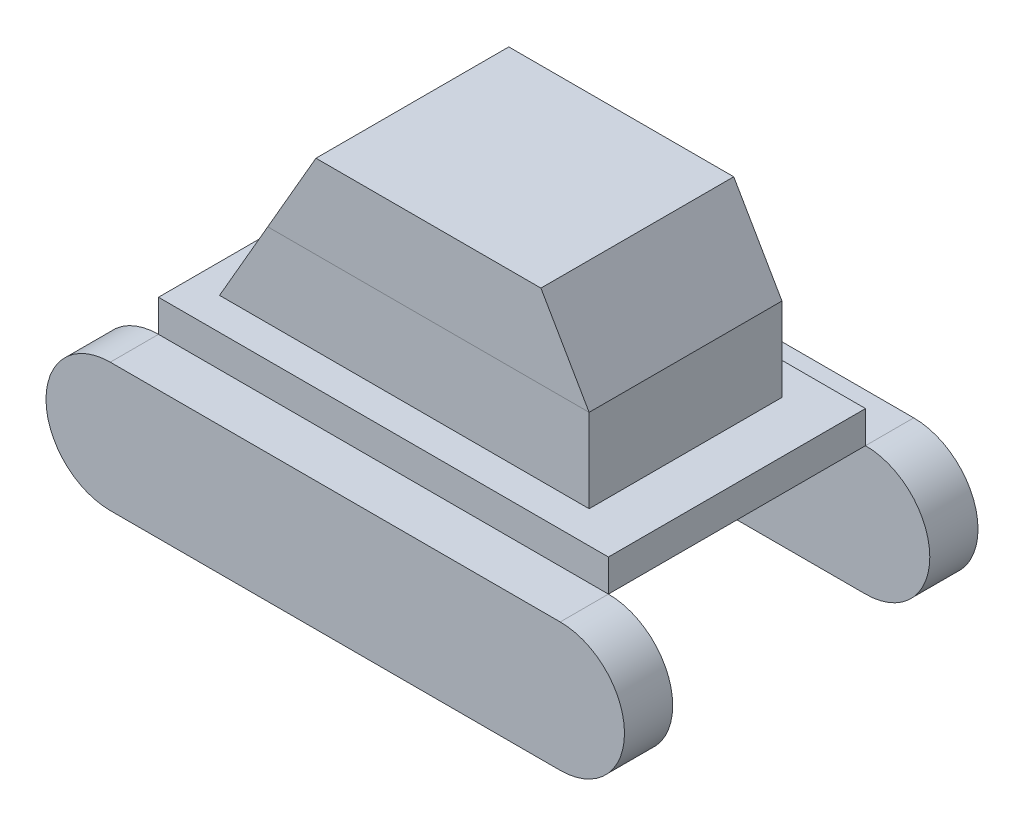
ISO-10303-21;
HEADER;
FILE_DESCRIPTION(('STEP AP214'),'2;1');
FILE_NAME('part.step','',(''),(''),'','','');
FILE_SCHEMA(('AUTOMOTIVE_DESIGN { 1 0 10303 214 1 1 1 1 }'));
ENDSEC;
DATA;
#1=APPLICATION_CONTEXT('core data for automotive mechanical design processes');
#2=APPLICATION_PROTOCOL_DEFINITION('international standard','automotive_design',2000,#1);
#3=PRODUCT_CONTEXT('',#1,'mechanical');
#4=PRODUCT('Part','Part','',(#3));
#5=PRODUCT_RELATED_PRODUCT_CATEGORY('part','',(#4));
#6=PRODUCT_DEFINITION_FORMATION('','',#4);
#7=PRODUCT_DEFINITION_CONTEXT('part definition',#1,'design');
#8=PRODUCT_DEFINITION('design','',#6,#7);
#9=PRODUCT_DEFINITION_SHAPE('','',#8);
#10=(LENGTH_UNIT() NAMED_UNIT(*) SI_UNIT(.MILLI.,.METRE.));
#11=(NAMED_UNIT(*) PLANE_ANGLE_UNIT() SI_UNIT($,.RADIAN.));
#12=(NAMED_UNIT(*) SI_UNIT($,.STERADIAN.) SOLID_ANGLE_UNIT());
#13=UNCERTAINTY_MEASURE_WITH_UNIT(LENGTH_MEASURE(1.E-05),#10,'distance_accuracy_value','');
#14=(GEOMETRIC_REPRESENTATION_CONTEXT(3) GLOBAL_UNCERTAINTY_ASSIGNED_CONTEXT((#13)) GLOBAL_UNIT_ASSIGNED_CONTEXT((#10,
#11,#12)) REPRESENTATION_CONTEXT('',''));
#15=CARTESIAN_POINT('',(0.,0.,0.));
#16=DIRECTION('',(0.,0.,1.));
#17=DIRECTION('',(1.,0.,0.));
#18=AXIS2_PLACEMENT_3D('',#15,#16,#17);
#19=CARTESIAN_POINT('',(0.,20.,110.));
#20=DIRECTION('',(0.,0.,-1.));
#21=DIRECTION('',(-1.,0.,0.));
#22=AXIS2_PLACEMENT_3D('',#19,#20,#21);
#23=CYLINDRICAL_SURFACE('',#22,20.);
#24=CARTESIAN_POINT('',(0.,20.,95.));
#25=DIRECTION('',(0.,0.,1.));
#26=DIRECTION('',(1.,0.,0.));
#27=AXIS2_PLACEMENT_3D('',#24,#25,#26);
#28=CIRCLE('',#27,20.);
#29=CARTESIAN_POINT('',(0.,40.,95.));
#30=VERTEX_POINT('',#29);
#31=CARTESIAN_POINT('',(0.,0.,95.));
#32=VERTEX_POINT('',#31);
#33=EDGE_CURVE('E110',#30,#32,#28,.T.);
#34=ORIENTED_EDGE('',*,*,#33,.T.);
#35=DIRECTION('',(0.,0.,-1.));
#36=VECTOR('',#35,1.);
#37=CARTESIAN_POINT('',(0.,0.,110.));
#38=LINE('',#37,#36);
#39=CARTESIAN_POINT('',(0.,0.,110.));
#40=VERTEX_POINT('',#39);
#41=EDGE_CURVE('E12',#40,#32,#38,.T.);
#42=ORIENTED_EDGE('',*,*,#41,.F.);
#43=CARTESIAN_POINT('',(0.,20.,110.));
#44=DIRECTION('',(0.,0.,1.));
#45=DIRECTION('',(1.,0.,0.));
#46=AXIS2_PLACEMENT_3D('',#43,#44,#45);
#47=CIRCLE('',#46,20.);
#48=CARTESIAN_POINT('',(0.,40.,110.));
#49=VERTEX_POINT('',#48);
#50=EDGE_CURVE('E98',#49,#40,#47,.T.);
#51=ORIENTED_EDGE('',*,*,#50,.F.);
#52=DIRECTION('',(0.,0.,-1.));
#53=VECTOR('',#52,1.);
#54=CARTESIAN_POINT('',(0.,40.,110.));
#55=LINE('',#54,#53);
#56=EDGE_CURVE('E106',#49,#30,#55,.T.);
#57=ORIENTED_EDGE('',*,*,#56,.T.);
#58=EDGE_LOOP('',(#34,#42,#51,#57));
#59=FACE_BOUND('',#58,.T.);
#60=ADVANCED_FACE('F47',(#59),#23,.T.);
#61=CARTESIAN_POINT('',(0.,0.,110.));
#62=DIRECTION('',(0.,1.,0.));
#63=DIRECTION('',(-1.,0.,0.));
#64=AXIS2_PLACEMENT_3D('',#61,#62,#63);
#65=PLANE('',#64);
#66=DIRECTION('',(1.,0.,0.));
#67=VECTOR('',#66,1.);
#68=CARTESIAN_POINT('',(0.,0.,95.));
#69=LINE('',#68,#67);
#70=CARTESIAN_POINT('',(140.,0.,95.));
#71=VERTEX_POINT('',#70);
#72=EDGE_CURVE('E102',#32,#71,#69,.T.);
#73=ORIENTED_EDGE('',*,*,#72,.T.);
#74=DIRECTION('',(0.,0.,-1.));
#75=VECTOR('',#74,1.);
#76=CARTESIAN_POINT('',(140.,0.,110.));
#77=LINE('',#76,#75);
#78=CARTESIAN_POINT('',(140.,0.,110.));
#79=VERTEX_POINT('',#78);
#80=EDGE_CURVE('E55',#79,#71,#77,.T.);
#81=ORIENTED_EDGE('',*,*,#80,.F.);
#82=DIRECTION('',(1.,0.,0.));
#83=VECTOR('',#82,1.);
#84=CARTESIAN_POINT('',(0.,0.,110.));
#85=LINE('',#84,#83);
#86=EDGE_CURVE('E93',#40,#79,#85,.T.);
#87=ORIENTED_EDGE('',*,*,#86,.F.);
#88=ORIENTED_EDGE('',*,*,#41,.T.);
#89=EDGE_LOOP('',(#73,#81,#87,#88));
#90=FACE_BOUND('',#89,.T.);
#91=ADVANCED_FACE('F101',(#90),#65,.F.);
#92=CARTESIAN_POINT('',(140.,20.,110.));
#93=DIRECTION('',(0.,0.,-1.));
#94=DIRECTION('',(-1.,0.,0.));
#95=AXIS2_PLACEMENT_3D('',#92,#93,#94);
#96=CYLINDRICAL_SURFACE('',#95,20.);
#97=CARTESIAN_POINT('',(140.,20.,95.));
#98=DIRECTION('',(0.,0.,1.));
#99=DIRECTION('',(1.,0.,0.));
#100=AXIS2_PLACEMENT_3D('',#97,#98,#99);
#101=CIRCLE('',#100,20.);
#102=CARTESIAN_POINT('',(140.,40.,95.));
#103=VERTEX_POINT('',#102);
#104=EDGE_CURVE('E80',#71,#103,#101,.T.);
#105=ORIENTED_EDGE('',*,*,#104,.T.);
#106=DIRECTION('',(0.,0.,-1.));
#107=VECTOR('',#106,1.);
#108=CARTESIAN_POINT('',(140.,40.,110.));
#109=LINE('',#108,#107);
#110=CARTESIAN_POINT('',(140.,40.,110.));
#111=VERTEX_POINT('',#110);
#112=EDGE_CURVE('E103',#111,#103,#109,.T.);
#113=ORIENTED_EDGE('',*,*,#112,.F.);
#114=CARTESIAN_POINT('',(140.,20.,110.));
#115=DIRECTION('',(0.,0.,1.));
#116=DIRECTION('',(1.,0.,0.));
#117=AXIS2_PLACEMENT_3D('',#114,#115,#116);
#118=CIRCLE('',#117,20.);
#119=EDGE_CURVE('E96',#79,#111,#118,.T.);
#120=ORIENTED_EDGE('',*,*,#119,.F.);
#121=ORIENTED_EDGE('',*,*,#80,.T.);
#122=EDGE_LOOP('',(#105,#113,#120,#121));
#123=FACE_BOUND('',#122,.T.);
#124=ADVANCED_FACE('F104',(#123),#96,.T.);
#125=CARTESIAN_POINT('',(0.,40.,110.));
#126=DIRECTION('',(0.,-1.,0.));
#127=DIRECTION('',(1.,0.,0.));
#128=AXIS2_PLACEMENT_3D('',#125,#126,#127);
#129=PLANE('',#128);
#130=DIRECTION('',(-1.,0.,0.));
#131=VECTOR('',#130,1.);
#132=CARTESIAN_POINT('',(0.,40.,95.));
#133=LINE('',#132,#131);
#134=EDGE_CURVE('E86',#103,#30,#133,.T.);
#135=ORIENTED_EDGE('',*,*,#134,.T.);
#136=ORIENTED_EDGE('',*,*,#56,.F.);
#137=DIRECTION('',(-1.,0.,0.));
#138=VECTOR('',#137,1.);
#139=CARTESIAN_POINT('',(0.,40.,110.));
#140=LINE('',#139,#138);
#141=EDGE_CURVE('E63',#111,#49,#140,.T.);
#142=ORIENTED_EDGE('',*,*,#141,.F.);
#143=ORIENTED_EDGE('',*,*,#112,.T.);
#144=EDGE_LOOP('',(#135,#136,#142,#143));
#145=FACE_BOUND('',#144,.T.);
#146=ADVANCED_FACE('F117',(#145),#129,.F.);
#147=CARTESIAN_POINT('',(0.,20.,110.));
#148=DIRECTION('',(0.,0.,1.));
#149=DIRECTION('',(1.,0.,0.));
#150=AXIS2_PLACEMENT_3D('',#147,#148,#149);
#151=PLANE('',#150);
#152=ORIENTED_EDGE('',*,*,#50,.T.);
#153=ORIENTED_EDGE('',*,*,#86,.T.);
#154=ORIENTED_EDGE('',*,*,#119,.T.);
#155=ORIENTED_EDGE('',*,*,#141,.T.);
#156=EDGE_LOOP('',(#152,#153,#154,#155));
#157=FACE_BOUND('',#156,.T.);
#158=ADVANCED_FACE('F94',(#157),#151,.T.);
#159=CARTESIAN_POINT('',(0.,20.,95.));
#160=DIRECTION('',(0.,0.,1.));
#161=DIRECTION('',(1.,0.,0.));
#162=AXIS2_PLACEMENT_3D('',#159,#160,#161);
#163=PLANE('',#162);
#164=ORIENTED_EDGE('',*,*,#33,.F.);
#165=ORIENTED_EDGE('',*,*,#134,.F.);
#166=ORIENTED_EDGE('',*,*,#104,.F.);
#167=ORIENTED_EDGE('',*,*,#72,.F.);
#168=EDGE_LOOP('',(#164,#165,#166,#167));
#169=FACE_BOUND('',#168,.T.);
#170=ADVANCED_FACE('F120',(#169),#163,.F.);
#171=CLOSED_SHELL('',(#60,#91,#124,#146,#158,#170));
#172=MANIFOLD_SOLID_BREP('B2',#171);
#173=CARTESIAN_POINT('',(9.,50.,85.));
#174=DIRECTION('',(-0.866025403784436,0.500000000000004,0.));
#175=DIRECTION('',(-0.500000000000004,-0.866025403784436,0.));
#176=AXIS2_PLACEMENT_3D('',#173,#174,#175);
#177=PLANE('',#176);
#178=DIRECTION('',(0.,0.,-1.));
#179=VECTOR('',#178,1.);
#180=CARTESIAN_POINT('',(24.0000000000001,75.9807621135331,85.));
#181=LINE('',#180,#179);
#182=CARTESIAN_POINT('',(24.0000000000001,75.9807621135331,55.));
#183=VERTEX_POINT('',#182);
#184=CARTESIAN_POINT('',(24.0000000000001,75.9807621135331,25.));
#185=VERTEX_POINT('',#184);
#186=EDGE_CURVE('E365',#183,#185,#181,.T.);
#187=ORIENTED_EDGE('',*,*,#186,.F.);
#188=DIRECTION('',(0.500000000000004,0.866025403784436,0.));
#189=VECTOR('',#188,1.);
#190=CARTESIAN_POINT('',(9.,50.,55.));
#191=LINE('',#190,#189);
#192=CARTESIAN_POINT('',(39.0000000000002,101.961524227066,55.));
#193=VERTEX_POINT('',#192);
#194=EDGE_CURVE('E45',#183,#193,#191,.T.);
#195=ORIENTED_EDGE('',*,*,#194,.T.);
#196=DIRECTION('',(0.,0.,-1.));
#197=VECTOR('',#196,1.);
#198=CARTESIAN_POINT('',(39.0000000000002,101.961524227066,85.));
#199=LINE('',#198,#197);
#200=CARTESIAN_POINT('',(39.0000000000002,101.961524227066,25.));
#201=VERTEX_POINT('',#200);
#202=EDGE_CURVE('E283',#193,#201,#199,.T.);
#203=ORIENTED_EDGE('',*,*,#202,.T.);
#204=DIRECTION('',(0.500000000000004,0.866025403784436,0.));
#205=VECTOR('',#204,1.);
#206=CARTESIAN_POINT('',(9.,50.,25.));
#207=LINE('',#206,#205);
#208=EDGE_CURVE('E315',#185,#201,#207,.T.);
#209=ORIENTED_EDGE('',*,*,#208,.F.);
#210=EDGE_LOOP('',(#187,#195,#203,#209));
#211=FACE_BOUND('',#210,.T.);
#212=ADVANCED_FACE('F192',(#211),#177,.T.);
#213=DIRECTION('',(0.500000000000004,0.866025403784436,0.));
#214=VECTOR('',#213,1.);
#215=CARTESIAN_POINT('',(9.,50.,85.));
#216=LINE('',#215,#214);
#217=CARTESIAN_POINT('',(9.,50.,85.));
#218=VERTEX_POINT('',#217);
#219=CARTESIAN_POINT('',(24.0000000000001,75.9807621135331,85.));
#220=VERTEX_POINT('',#219);
#221=EDGE_CURVE('E276',#218,#220,#216,.T.);
#222=ORIENTED_EDGE('',*,*,#221,.T.);
#223=EDGE_CURVE('E201',#220,#183,#181,.T.);
#224=ORIENTED_EDGE('',*,*,#223,.T.);
#225=ORIENTED_EDGE('',*,*,#186,.T.);
#226=CARTESIAN_POINT('',(9.,50.,25.));
#227=VERTEX_POINT('',#226);
#228=EDGE_CURVE('E278',#227,#185,#207,.T.);
#229=ORIENTED_EDGE('',*,*,#228,.F.);
#230=DIRECTION('',(0.,0.,-1.));
#231=VECTOR('',#230,1.);
#232=CARTESIAN_POINT('',(9.,50.,85.));
#233=LINE('',#232,#231);
#234=EDGE_CURVE('E272',#218,#227,#233,.T.);
#235=ORIENTED_EDGE('',*,*,#234,.F.);
#236=EDGE_LOOP('',(#222,#224,#225,#229,#235));
#237=FACE_BOUND('',#236,.T.);
#238=ADVANCED_FACE('F274',(#237),#177,.T.);
#239=CARTESIAN_POINT('',(0.,0.,25.));
#240=DIRECTION('',(0.,0.,1.));
#241=DIRECTION('',(1.,0.,0.));
#242=AXIS2_PLACEMENT_3D('',#239,#240,#241);
#243=PLANE('',#242);
#244=DIRECTION('',(-1.,0.,0.));
#245=VECTOR('',#244,1.);
#246=CARTESIAN_POINT('',(0.,75.9807621135331,25.));
#247=LINE('',#246,#245);
#248=CARTESIAN_POINT('',(124.,75.980762113533,25.));
#249=VERTEX_POINT('',#248);
#250=EDGE_CURVE('E362',#249,#185,#247,.T.);
#251=ORIENTED_EDGE('',*,*,#250,.F.);
#252=DIRECTION('',(0.,-1.,0.));
#253=VECTOR('',#252,1.);
#254=CARTESIAN_POINT('',(124.,75.980762113533,25.));
#255=LINE('',#254,#253);
#256=CARTESIAN_POINT('',(124.,50.,25.));
#257=VERTEX_POINT('',#256);
#258=EDGE_CURVE('E302',#249,#257,#255,.T.);
#259=ORIENTED_EDGE('',*,*,#258,.T.);
#260=DIRECTION('',(-1.,0.,0.));
#261=VECTOR('',#260,1.);
#262=CARTESIAN_POINT('',(124.,50.,25.));
#263=LINE('',#262,#261);
#264=EDGE_CURVE('E313',#257,#227,#263,.T.);
#265=ORIENTED_EDGE('',*,*,#264,.T.);
#266=ORIENTED_EDGE('',*,*,#228,.T.);
#267=EDGE_LOOP('',(#251,#259,#265,#266));
#268=FACE_BOUND('',#267,.T.);
#269=ADVANCED_FACE('F380',(#268),#243,.F.);
#270=CARTESIAN_POINT('',(0.,0.,85.));
#271=DIRECTION('',(0.,0.,1.));
#272=DIRECTION('',(1.,0.,0.));
#273=AXIS2_PLACEMENT_3D('',#270,#271,#272);
#274=PLANE('',#273);
#275=CARTESIAN_POINT('',(39.0000000000002,101.961524227066,85.));
#276=VERTEX_POINT('',#275);
#277=EDGE_CURVE('E295',#220,#276,#216,.T.);
#278=ORIENTED_EDGE('',*,*,#277,.F.);
#279=DIRECTION('',(1.,0.,0.));
#280=VECTOR('',#279,1.);
#281=CARTESIAN_POINT('',(0.,75.9807621135331,85.));
#282=LINE('',#281,#280);
#283=CARTESIAN_POINT('',(124.,75.980762113533,85.));
#284=VERTEX_POINT('',#283);
#285=EDGE_CURVE('E292',#220,#284,#282,.T.);
#286=ORIENTED_EDGE('',*,*,#285,.T.);
#287=DIRECTION('',(0.499999999999998,-0.86602540378444,0.));
#288=VECTOR('',#287,1.);
#289=CARTESIAN_POINT('',(109.,101.961524227066,85.));
#290=LINE('',#289,#288);
#291=CARTESIAN_POINT('',(109.,101.961524227066,85.));
#292=VERTEX_POINT('',#291);
#293=EDGE_CURVE('E309',#292,#284,#290,.T.);
#294=ORIENTED_EDGE('',*,*,#293,.F.);
#295=DIRECTION('',(1.,0.,0.));
#296=VECTOR('',#295,1.);
#297=CARTESIAN_POINT('',(39.0000000000002,101.961524227066,85.));
#298=LINE('',#297,#296);
#299=EDGE_CURVE('E294',#276,#292,#298,.T.);
#300=ORIENTED_EDGE('',*,*,#299,.F.);
#301=EDGE_LOOP('',(#278,#286,#294,#300));
#302=FACE_BOUND('',#301,.T.);
#303=ADVANCED_FACE('F389',(#302),#274,.T.);
#304=CARTESIAN_POINT('',(0.,50.,15.));
#305=DIRECTION('',(1.,0.,0.));
#306=DIRECTION('',(0.,0.,-1.));
#307=AXIS2_PLACEMENT_3D('',#304,#305,#306);
#308=PLANE('',#307);
#309=DIRECTION('',(0.,0.,1.));
#310=VECTOR('',#309,1.);
#311=CARTESIAN_POINT('',(0.,40.,15.));
#312=LINE('',#311,#310);
#313=CARTESIAN_POINT('',(0.,40.,15.));
#314=VERTEX_POINT('',#313);
#315=CARTESIAN_POINT('',(0.,40.,95.));
#316=VERTEX_POINT('',#315);
#317=EDGE_CURVE('E323',#314,#316,#312,.T.);
#318=ORIENTED_EDGE('',*,*,#317,.T.);
#319=DIRECTION('',(0.,-1.,0.));
#320=VECTOR('',#319,1.);
#321=CARTESIAN_POINT('',(0.,50.,95.));
#322=LINE('',#321,#320);
#323=CARTESIAN_POINT('',(0.,50.,95.));
#324=VERTEX_POINT('',#323);
#325=EDGE_CURVE('E357',#324,#316,#322,.T.);
#326=ORIENTED_EDGE('',*,*,#325,.F.);
#327=DIRECTION('',(0.,0.,1.));
#328=VECTOR('',#327,1.);
#329=CARTESIAN_POINT('',(0.,50.,15.));
#330=LINE('',#329,#328);
#331=CARTESIAN_POINT('',(0.,50.,15.));
#332=VERTEX_POINT('',#331);
#333=EDGE_CURVE('E331',#332,#324,#330,.T.);
#334=ORIENTED_EDGE('',*,*,#333,.F.);
#335=DIRECTION('',(0.,-1.,0.));
#336=VECTOR('',#335,1.);
#337=CARTESIAN_POINT('',(0.,50.,15.));
#338=LINE('',#337,#336);
#339=EDGE_CURVE('E341',#332,#314,#338,.T.);
#340=ORIENTED_EDGE('',*,*,#339,.T.);
#341=EDGE_LOOP('',(#318,#326,#334,#340));
#342=FACE_BOUND('',#341,.T.);
#343=ADVANCED_FACE('F194',(#342),#308,.F.);
#344=CARTESIAN_POINT('',(0.,50.,95.));
#345=DIRECTION('',(0.,0.,-1.));
#346=DIRECTION('',(-1.,0.,0.));
#347=AXIS2_PLACEMENT_3D('',#344,#345,#346);
#348=PLANE('',#347);
#349=DIRECTION('',(1.,0.,0.));
#350=VECTOR('',#349,1.);
#351=CARTESIAN_POINT('',(0.,40.,95.));
#352=LINE('',#351,#350);
#353=CARTESIAN_POINT('',(140.,40.,95.));
#354=VERTEX_POINT('',#353);
#355=EDGE_CURVE('E344',#316,#354,#352,.T.);
#356=ORIENTED_EDGE('',*,*,#355,.T.);
#357=DIRECTION('',(0.,-1.,0.));
#358=VECTOR('',#357,1.);
#359=CARTESIAN_POINT('',(140.,50.,95.));
#360=LINE('',#359,#358);
#361=CARTESIAN_POINT('',(140.,50.,95.));
#362=VERTEX_POINT('',#361);
#363=EDGE_CURVE('E354',#362,#354,#360,.T.);
#364=ORIENTED_EDGE('',*,*,#363,.F.);
#365=DIRECTION('',(1.,0.,0.));
#366=VECTOR('',#365,1.);
#367=CARTESIAN_POINT('',(0.,50.,95.));
#368=LINE('',#367,#366);
#369=EDGE_CURVE('E334',#324,#362,#368,.T.);
#370=ORIENTED_EDGE('',*,*,#369,.F.);
#371=ORIENTED_EDGE('',*,*,#325,.T.);
#372=EDGE_LOOP('',(#356,#364,#370,#371));
#373=FACE_BOUND('',#372,.T.);
#374=ADVANCED_FACE('F450',(#373),#348,.F.);
#375=CARTESIAN_POINT('',(140.,50.,15.));
#376=DIRECTION('',(-1.,0.,0.));
#377=DIRECTION('',(0.,0.,1.));
#378=AXIS2_PLACEMENT_3D('',#375,#376,#377);
#379=PLANE('',#378);
#380=DIRECTION('',(0.,0.,-1.));
#381=VECTOR('',#380,1.);
#382=CARTESIAN_POINT('',(140.,40.,15.));
#383=LINE('',#382,#381);
#384=CARTESIAN_POINT('',(140.,40.,15.));
#385=VERTEX_POINT('',#384);
#386=EDGE_CURVE('E346',#354,#385,#383,.T.);
#387=ORIENTED_EDGE('',*,*,#386,.T.);
#388=DIRECTION('',(0.,-1.,0.));
#389=VECTOR('',#388,1.);
#390=CARTESIAN_POINT('',(140.,50.,15.));
#391=LINE('',#390,#389);
#392=CARTESIAN_POINT('',(140.,50.,15.));
#393=VERTEX_POINT('',#392);
#394=EDGE_CURVE('E351',#393,#385,#391,.T.);
#395=ORIENTED_EDGE('',*,*,#394,.F.);
#396=DIRECTION('',(0.,0.,-1.));
#397=VECTOR('',#396,1.);
#398=CARTESIAN_POINT('',(140.,50.,15.));
#399=LINE('',#398,#397);
#400=EDGE_CURVE('E337',#362,#393,#399,.T.);
#401=ORIENTED_EDGE('',*,*,#400,.F.);
#402=ORIENTED_EDGE('',*,*,#363,.T.);
#403=EDGE_LOOP('',(#387,#395,#401,#402));
#404=FACE_BOUND('',#403,.T.);
#405=ADVANCED_FACE('F495',(#404),#379,.F.);
#406=CARTESIAN_POINT('',(0.,50.,15.));
#407=DIRECTION('',(0.,0.,1.));
#408=DIRECTION('',(1.,0.,0.));
#409=AXIS2_PLACEMENT_3D('',#406,#407,#408);
#410=PLANE('',#409);
#411=DIRECTION('',(-1.,0.,0.));
#412=VECTOR('',#411,1.);
#413=CARTESIAN_POINT('',(0.,40.,15.));
#414=LINE('',#413,#412);
#415=EDGE_CURVE('E335',#385,#314,#414,.T.);
#416=ORIENTED_EDGE('',*,*,#415,.T.);
#417=ORIENTED_EDGE('',*,*,#339,.F.);
#418=DIRECTION('',(-1.,0.,0.));
#419=VECTOR('',#418,1.);
#420=CARTESIAN_POINT('',(0.,50.,15.));
#421=LINE('',#420,#419);
#422=EDGE_CURVE('E339',#393,#332,#421,.T.);
#423=ORIENTED_EDGE('',*,*,#422,.F.);
#424=ORIENTED_EDGE('',*,*,#394,.T.);
#425=EDGE_LOOP('',(#416,#417,#423,#424));
#426=FACE_BOUND('',#425,.T.);
#427=ADVANCED_FACE('F490',(#426),#410,.F.);
#428=CARTESIAN_POINT('',(0.,50.,0.));
#429=DIRECTION('',(0.,1.,0.));
#430=DIRECTION('',(0.,0.,1.));
#431=AXIS2_PLACEMENT_3D('',#428,#429,#430);
#432=PLANE('',#431);
#433=DIRECTION('',(-1.,0.,0.));
#434=VECTOR('',#433,1.);
#435=CARTESIAN_POINT('',(124.,50.,85.));
#436=LINE('',#435,#434);
#437=CARTESIAN_POINT('',(124.,50.,85.));
#438=VERTEX_POINT('',#437);
#439=EDGE_CURVE('E290',#438,#218,#436,.T.);
#440=ORIENTED_EDGE('',*,*,#439,.T.);
#441=ORIENTED_EDGE('',*,*,#234,.T.);
#442=ORIENTED_EDGE('',*,*,#264,.F.);
#443=DIRECTION('',(0.,0.,-1.));
#444=VECTOR('',#443,1.);
#445=CARTESIAN_POINT('',(124.,50.,85.));
#446=LINE('',#445,#444);
#447=EDGE_CURVE('E301',#438,#257,#446,.T.);
#448=ORIENTED_EDGE('',*,*,#447,.F.);
#449=EDGE_LOOP('',(#440,#441,#442,#448));
#450=FACE_BOUND('',#449,.T.);
#451=ORIENTED_EDGE('',*,*,#333,.T.);
#452=ORIENTED_EDGE('',*,*,#369,.T.);
#453=ORIENTED_EDGE('',*,*,#400,.T.);
#454=ORIENTED_EDGE('',*,*,#422,.T.);
#455=EDGE_LOOP('',(#451,#452,#453,#454));
#456=FACE_BOUND('',#455,.T.);
#457=ADVANCED_FACE('F298',(#450,#456),#432,.T.);
#458=CARTESIAN_POINT('',(0.,40.,0.));
#459=DIRECTION('',(0.,1.,0.));
#460=DIRECTION('',(0.,0.,1.));
#461=AXIS2_PLACEMENT_3D('',#458,#459,#460);
#462=PLANE('',#461);
#463=ORIENTED_EDGE('',*,*,#317,.F.);
#464=ORIENTED_EDGE('',*,*,#415,.F.);
#465=ORIENTED_EDGE('',*,*,#386,.F.);
#466=ORIENTED_EDGE('',*,*,#355,.F.);
#467=EDGE_LOOP('',(#463,#464,#465,#466));
#468=FACE_BOUND('',#467,.T.);
#469=ADVANCED_FACE('F508',(#468),#462,.F.);
#470=CARTESIAN_POINT('',(124.,75.980762113533,85.));
#471=DIRECTION('',(1.,0.,0.));
#472=DIRECTION('',(0.,0.,-1.));
#473=AXIS2_PLACEMENT_3D('',#470,#471,#472);
#474=PLANE('',#473);
#475=ORIENTED_EDGE('',*,*,#258,.F.);
#476=DIRECTION('',(0.,0.,-1.));
#477=VECTOR('',#476,1.);
#478=CARTESIAN_POINT('',(124.,75.980762113533,85.));
#479=LINE('',#478,#477);
#480=EDGE_CURVE('E324',#284,#249,#479,.T.);
#481=ORIENTED_EDGE('',*,*,#480,.F.);
#482=DIRECTION('',(0.,-1.,0.));
#483=VECTOR('',#482,1.);
#484=CARTESIAN_POINT('',(124.,75.980762113533,85.));
#485=LINE('',#484,#483);
#486=EDGE_CURVE('E284',#284,#438,#485,.T.);
#487=ORIENTED_EDGE('',*,*,#486,.T.);
#488=ORIENTED_EDGE('',*,*,#447,.T.);
#489=EDGE_LOOP('',(#475,#481,#487,#488));
#490=FACE_BOUND('',#489,.T.);
#491=ADVANCED_FACE('F383',(#490),#474,.T.);
#492=CARTESIAN_POINT('',(109.,101.961524227066,85.));
#493=DIRECTION('',(0.86602540378444,0.499999999999998,0.));
#494=DIRECTION('',(-0.499999999999998,0.86602540378444,0.));
#495=AXIS2_PLACEMENT_3D('',#492,#493,#494);
#496=PLANE('',#495);
#497=DIRECTION('',(0.499999999999998,-0.86602540378444,0.));
#498=VECTOR('',#497,1.);
#499=CARTESIAN_POINT('',(109.,101.961524227066,25.));
#500=LINE('',#499,#498);
#501=CARTESIAN_POINT('',(109.,101.961524227066,25.));
#502=VERTEX_POINT('',#501);
#503=EDGE_CURVE('E304',#502,#249,#500,.T.);
#504=ORIENTED_EDGE('',*,*,#503,.F.);
#505=DIRECTION('',(0.,0.,-1.));
#506=VECTOR('',#505,1.);
#507=CARTESIAN_POINT('',(109.,101.961524227066,85.));
#508=LINE('',#507,#506);
#509=EDGE_CURVE('E327',#292,#502,#508,.T.);
#510=ORIENTED_EDGE('',*,*,#509,.F.);
#511=ORIENTED_EDGE('',*,*,#293,.T.);
#512=ORIENTED_EDGE('',*,*,#480,.T.);
#513=EDGE_LOOP('',(#504,#510,#511,#512));
#514=FACE_BOUND('',#513,.T.);
#515=ADVANCED_FACE('F386',(#514),#496,.T.);
#516=CARTESIAN_POINT('',(39.0000000000002,101.961524227066,85.));
#517=DIRECTION('',(0.,1.,0.));
#518=DIRECTION('',(0.,0.,1.));
#519=AXIS2_PLACEMENT_3D('',#516,#517,#518);
#520=PLANE('',#519);
#521=DIRECTION('',(1.,0.,0.));
#522=VECTOR('',#521,1.);
#523=CARTESIAN_POINT('',(39.0000000000002,101.961524227066,25.));
#524=LINE('',#523,#522);
#525=EDGE_CURVE('E317',#201,#502,#524,.T.);
#526=ORIENTED_EDGE('',*,*,#525,.F.);
#527=ORIENTED_EDGE('',*,*,#202,.F.);
#528=EDGE_CURVE('E329',#276,#193,#199,.T.);
#529=ORIENTED_EDGE('',*,*,#528,.F.);
#530=ORIENTED_EDGE('',*,*,#299,.T.);
#531=ORIENTED_EDGE('',*,*,#509,.T.);
#532=EDGE_LOOP('',(#526,#527,#529,#530,#531));
#533=FACE_BOUND('',#532,.T.);
#534=ADVANCED_FACE('F392',(#533),#520,.T.);
#535=ORIENTED_EDGE('',*,*,#194,.F.);
#536=ORIENTED_EDGE('',*,*,#223,.F.);
#537=ORIENTED_EDGE('',*,*,#277,.T.);
#538=ORIENTED_EDGE('',*,*,#528,.T.);
#539=EDGE_LOOP('',(#535,#536,#537,#538));
#540=FACE_BOUND('',#539,.T.);
#541=ADVANCED_FACE('F393',(#540),#177,.T.);
#542=ORIENTED_EDGE('',*,*,#285,.F.);
#543=ORIENTED_EDGE('',*,*,#221,.F.);
#544=ORIENTED_EDGE('',*,*,#439,.F.);
#545=ORIENTED_EDGE('',*,*,#486,.F.);
#546=EDGE_LOOP('',(#542,#543,#544,#545));
#547=FACE_BOUND('',#546,.T.);
#548=ADVANCED_FACE('F288',(#547),#274,.T.);
#549=ORIENTED_EDGE('',*,*,#503,.T.);
#550=ORIENTED_EDGE('',*,*,#250,.T.);
#551=ORIENTED_EDGE('',*,*,#208,.T.);
#552=ORIENTED_EDGE('',*,*,#525,.T.);
#553=EDGE_LOOP('',(#549,#550,#551,#552));
#554=FACE_BOUND('',#553,.T.);
#555=ADVANCED_FACE('F375',(#554),#243,.F.);
#556=CLOSED_SHELL('',(#212,#238,#269,#303,#343,#374,#405,#427,#457,#469,#491,#515,#534,#541,
#548,#555));
#557=MANIFOLD_SOLID_BREP('B6',#556);
#558=CARTESIAN_POINT('',(0.,20.,15.));
#559=DIRECTION('',(0.,0.,-1.));
#560=DIRECTION('',(-1.,0.,0.));
#561=AXIS2_PLACEMENT_3D('',#558,#559,#560);
#562=CYLINDRICAL_SURFACE('',#561,20.);
#563=CARTESIAN_POINT('',(0.,20.,0.));
#564=DIRECTION('',(0.,0.,1.));
#565=DIRECTION('',(1.,0.,0.));
#566=AXIS2_PLACEMENT_3D('',#563,#564,#565);
#567=CIRCLE('',#566,20.);
#568=CARTESIAN_POINT('',(0.,40.,0.));
#569=VERTEX_POINT('',#568);
#570=CARTESIAN_POINT('',(0.,0.,0.));
#571=VERTEX_POINT('',#570);
#572=EDGE_CURVE('E657',#569,#571,#567,.T.);
#573=ORIENTED_EDGE('',*,*,#572,.T.);
#574=DIRECTION('',(0.,0.,-1.));
#575=VECTOR('',#574,1.);
#576=CARTESIAN_POINT('',(0.,0.,15.));
#577=LINE('',#576,#575);
#578=CARTESIAN_POINT('',(0.,0.,15.));
#579=VERTEX_POINT('',#578);
#580=EDGE_CURVE('E190',#579,#571,#577,.T.);
#581=ORIENTED_EDGE('',*,*,#580,.F.);
#582=CARTESIAN_POINT('',(0.,20.,15.));
#583=DIRECTION('',(0.,0.,1.));
#584=DIRECTION('',(1.,0.,0.));
#585=AXIS2_PLACEMENT_3D('',#582,#583,#584);
#586=CIRCLE('',#585,20.);
#587=CARTESIAN_POINT('',(0.,40.,15.));
#588=VERTEX_POINT('',#587);
#589=EDGE_CURVE('E645',#588,#579,#586,.T.);
#590=ORIENTED_EDGE('',*,*,#589,.F.);
#591=DIRECTION('',(0.,0.,-1.));
#592=VECTOR('',#591,1.);
#593=CARTESIAN_POINT('',(0.,40.,15.));
#594=LINE('',#593,#592);
#595=EDGE_CURVE('E653',#588,#569,#594,.T.);
#596=ORIENTED_EDGE('',*,*,#595,.T.);
#597=EDGE_LOOP('',(#573,#581,#590,#596));
#598=FACE_BOUND('',#597,.T.);
#599=ADVANCED_FACE('F594',(#598),#562,.T.);
#600=CARTESIAN_POINT('',(0.,0.,15.));
#601=DIRECTION('',(0.,1.,0.));
#602=DIRECTION('',(0.,0.,1.));
#603=AXIS2_PLACEMENT_3D('',#600,#601,#602);
#604=PLANE('',#603);
#605=DIRECTION('',(1.,0.,0.));
#606=VECTOR('',#605,1.);
#607=CARTESIAN_POINT('',(0.,0.,0.));
#608=LINE('',#607,#606);
#609=CARTESIAN_POINT('',(140.,0.,0.));
#610=VERTEX_POINT('',#609);
#611=EDGE_CURVE('E649',#571,#610,#608,.T.);
#612=ORIENTED_EDGE('',*,*,#611,.T.);
#613=DIRECTION('',(0.,0.,-1.));
#614=VECTOR('',#613,1.);
#615=CARTESIAN_POINT('',(140.,0.,15.));
#616=LINE('',#615,#614);
#617=CARTESIAN_POINT('',(140.,0.,15.));
#618=VERTEX_POINT('',#617);
#619=EDGE_CURVE('E602',#618,#610,#616,.T.);
#620=ORIENTED_EDGE('',*,*,#619,.F.);
#621=DIRECTION('',(1.,0.,0.));
#622=VECTOR('',#621,1.);
#623=CARTESIAN_POINT('',(0.,0.,15.));
#624=LINE('',#623,#622);
#625=EDGE_CURVE('E640',#579,#618,#624,.T.);
#626=ORIENTED_EDGE('',*,*,#625,.F.);
#627=ORIENTED_EDGE('',*,*,#580,.T.);
#628=EDGE_LOOP('',(#612,#620,#626,#627));
#629=FACE_BOUND('',#628,.T.);
#630=ADVANCED_FACE('F648',(#629),#604,.F.);
#631=CARTESIAN_POINT('',(140.,20.,15.));
#632=DIRECTION('',(0.,0.,-1.));
#633=DIRECTION('',(-1.,0.,0.));
#634=AXIS2_PLACEMENT_3D('',#631,#632,#633);
#635=CYLINDRICAL_SURFACE('',#634,20.);
#636=CARTESIAN_POINT('',(140.,20.,0.));
#637=DIRECTION('',(0.,0.,1.));
#638=DIRECTION('',(1.,0.,0.));
#639=AXIS2_PLACEMENT_3D('',#636,#637,#638);
#640=CIRCLE('',#639,20.);
#641=CARTESIAN_POINT('',(140.,40.,0.));
#642=VERTEX_POINT('',#641);
#643=EDGE_CURVE('E627',#610,#642,#640,.T.);
#644=ORIENTED_EDGE('',*,*,#643,.T.);
#645=DIRECTION('',(0.,0.,-1.));
#646=VECTOR('',#645,1.);
#647=CARTESIAN_POINT('',(140.,40.,15.));
#648=LINE('',#647,#646);
#649=CARTESIAN_POINT('',(140.,40.,15.));
#650=VERTEX_POINT('',#649);
#651=EDGE_CURVE('E650',#650,#642,#648,.T.);
#652=ORIENTED_EDGE('',*,*,#651,.F.);
#653=CARTESIAN_POINT('',(140.,20.,15.));
#654=DIRECTION('',(0.,0.,1.));
#655=DIRECTION('',(1.,0.,0.));
#656=AXIS2_PLACEMENT_3D('',#653,#654,#655);
#657=CIRCLE('',#656,20.);
#658=EDGE_CURVE('E643',#618,#650,#657,.T.);
#659=ORIENTED_EDGE('',*,*,#658,.F.);
#660=ORIENTED_EDGE('',*,*,#619,.T.);
#661=EDGE_LOOP('',(#644,#652,#659,#660));
#662=FACE_BOUND('',#661,.T.);
#663=ADVANCED_FACE('F651',(#662),#635,.T.);
#664=CARTESIAN_POINT('',(0.,40.,15.));
#665=DIRECTION('',(0.,-1.,0.));
#666=DIRECTION('',(1.,0.,0.));
#667=AXIS2_PLACEMENT_3D('',#664,#665,#666);
#668=PLANE('',#667);
#669=DIRECTION('',(-1.,0.,0.));
#670=VECTOR('',#669,1.);
#671=CARTESIAN_POINT('',(0.,40.,0.));
#672=LINE('',#671,#670);
#673=EDGE_CURVE('E633',#642,#569,#672,.T.);
#674=ORIENTED_EDGE('',*,*,#673,.T.);
#675=ORIENTED_EDGE('',*,*,#595,.F.);
#676=DIRECTION('',(-1.,0.,0.));
#677=VECTOR('',#676,1.);
#678=CARTESIAN_POINT('',(0.,40.,15.));
#679=LINE('',#678,#677);
#680=EDGE_CURVE('E610',#650,#588,#679,.T.);
#681=ORIENTED_EDGE('',*,*,#680,.F.);
#682=ORIENTED_EDGE('',*,*,#651,.T.);
#683=EDGE_LOOP('',(#674,#675,#681,#682));
#684=FACE_BOUND('',#683,.T.);
#685=ADVANCED_FACE('F664',(#684),#668,.F.);
#686=CARTESIAN_POINT('',(0.,20.,15.));
#687=DIRECTION('',(0.,0.,1.));
#688=DIRECTION('',(1.,0.,0.));
#689=AXIS2_PLACEMENT_3D('',#686,#687,#688);
#690=PLANE('',#689);
#691=ORIENTED_EDGE('',*,*,#589,.T.);
#692=ORIENTED_EDGE('',*,*,#625,.T.);
#693=ORIENTED_EDGE('',*,*,#658,.T.);
#694=ORIENTED_EDGE('',*,*,#680,.T.);
#695=EDGE_LOOP('',(#691,#692,#693,#694));
#696=FACE_BOUND('',#695,.T.);
#697=ADVANCED_FACE('F641',(#696),#690,.T.);
#698=CARTESIAN_POINT('',(0.,20.,0.));
#699=DIRECTION('',(0.,0.,1.));
#700=DIRECTION('',(1.,0.,0.));
#701=AXIS2_PLACEMENT_3D('',#698,#699,#700);
#702=PLANE('',#701);
#703=ORIENTED_EDGE('',*,*,#572,.F.);
#704=ORIENTED_EDGE('',*,*,#673,.F.);
#705=ORIENTED_EDGE('',*,*,#643,.F.);
#706=ORIENTED_EDGE('',*,*,#611,.F.);
#707=EDGE_LOOP('',(#703,#704,#705,#706));
#708=FACE_BOUND('',#707,.T.);
#709=ADVANCED_FACE('F667',(#708),#702,.F.);
#710=CLOSED_SHELL('',(#599,#630,#663,#685,#697,#709));
#711=MANIFOLD_SOLID_BREP('B39',#710);
#712=ADVANCED_BREP_SHAPE_REPRESENTATION('',(#18,#172,#557,#711),#14);
#713=SHAPE_DEFINITION_REPRESENTATION(#9,#712);
ENDSEC;
END-ISO-10303-21;
